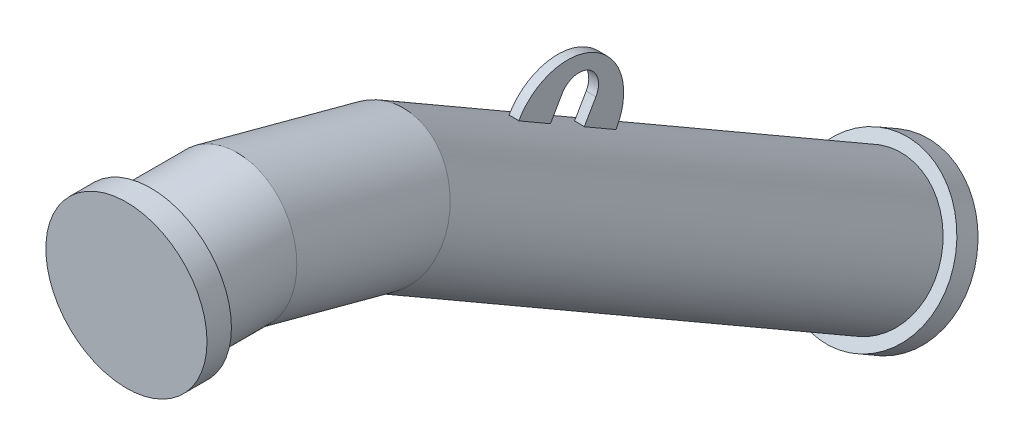
ISO-10303-21;
HEADER;
FILE_DESCRIPTION(('STEP AP214'),'2;1');
FILE_NAME('part.step','',(''),(''),'','','');
FILE_SCHEMA(('AUTOMOTIVE_DESIGN { 1 0 10303 214 1 1 1 1 }'));
ENDSEC;
DATA;
#1=APPLICATION_CONTEXT('core data for automotive mechanical design processes');
#2=APPLICATION_PROTOCOL_DEFINITION('international standard','automotive_design',2000,#1);
#3=PRODUCT_CONTEXT('',#1,'mechanical');
#4=PRODUCT('Part','Part','',(#3));
#5=PRODUCT_RELATED_PRODUCT_CATEGORY('part','',(#4));
#6=PRODUCT_DEFINITION_FORMATION('','',#4);
#7=PRODUCT_DEFINITION_CONTEXT('part definition',#1,'design');
#8=PRODUCT_DEFINITION('design','',#6,#7);
#9=PRODUCT_DEFINITION_SHAPE('','',#8);
#10=(LENGTH_UNIT() NAMED_UNIT(*) SI_UNIT(.MILLI.,.METRE.));
#11=(NAMED_UNIT(*) PLANE_ANGLE_UNIT() SI_UNIT($,.RADIAN.));
#12=(NAMED_UNIT(*) SI_UNIT($,.STERADIAN.) SOLID_ANGLE_UNIT());
#13=UNCERTAINTY_MEASURE_WITH_UNIT(LENGTH_MEASURE(1.E-05),#10,'distance_accuracy_value','');
#14=(GEOMETRIC_REPRESENTATION_CONTEXT(3) GLOBAL_UNCERTAINTY_ASSIGNED_CONTEXT((#13)) GLOBAL_UNIT_ASSIGNED_CONTEXT((#10,
#11,#12)) REPRESENTATION_CONTEXT('',''));
#15=CARTESIAN_POINT('',(0.,0.,0.));
#16=DIRECTION('',(0.,0.,1.));
#17=DIRECTION('',(1.,0.,0.));
#18=AXIS2_PLACEMENT_3D('',#15,#16,#17);
#19=CARTESIAN_POINT('',(4.99999999995946,-49.4113824755163,-458.35254037844));
#20=DIRECTION('',(1.,0.,0.));
#21=DIRECTION('',(0.,0.866025403784438,-0.500000000000001));
#22=AXIS2_PLACEMENT_3D('',#19,#20,#21);
#23=PLANE('',#22);
#24=DIRECTION('',(0.,0.866025403784438,-0.500000000000001));
#25=VECTOR('',#24,1.);
#26=CARTESIAN_POINT('',(4.99999999995948,-49.6732335022949,-391.806079660835));
#27=LINE('',#26,#25);
#28=CARTESIAN_POINT('',(4.99999999995948,-41.2980618055837,-396.64148729444));
#29=VERTEX_POINT('',#28);
#30=CARTESIAN_POINT('',(4.99999999995948,-41.0129794644506,-396.806079660835));
#31=VERTEX_POINT('',#30);
#32=EDGE_CURVE('E246',#29,#31,#27,.T.);
#33=ORIENTED_EDGE('',*,*,#32,.F.);
#34=DIRECTION('',(0.,-0.499999999999988,-0.866025403784404));
#35=VECTOR('',#34,1.);
#36=CARTESIAN_POINT('',(4.99999999995935,-230.552312529383,-724.43946509643));
#37=LINE('',#36,#35);
#38=CARTESIAN_POINT('',(4.9999999999587,-60.0480618055922,-429.117439936366));
#39=VERTEX_POINT('',#38);
#40=EDGE_CURVE('E50',#29,#39,#37,.T.);
#41=ORIENTED_EDGE('',*,*,#40,.T.);
#42=DIRECTION('',(0.,0.866025403784438,-0.500000000000001));
#43=VECTOR('',#42,1.);
#44=CARTESIAN_POINT('',(4.99999999995946,-59.7629794644506,-429.282032302751));
#45=LINE('',#44,#43);
#46=CARTESIAN_POINT('',(4.99999999995946,-39.4113824755163,-441.032032302751));
#47=VERTEX_POINT('',#46);
#48=EDGE_CURVE('E259',#39,#47,#45,.T.);
#49=ORIENTED_EDGE('',*,*,#48,.T.);
#50=CARTESIAN_POINT('',(4.99999999995946,-49.4113824755163,-458.35254037844));
#51=DIRECTION('',(-1.,0.,0.));
#52=DIRECTION('',(0.,0.866025403784438,-0.500000000000001));
#53=AXIS2_PLACEMENT_3D('',#50,#51,#52);
#54=CIRCLE('',#53,20.);
#55=CARTESIAN_POINT('',(4.99999999995945,-59.4113824755163,-475.673048454129));
#56=VERTEX_POINT('',#55);
#57=EDGE_CURVE('E262',#47,#56,#54,.T.);
#58=ORIENTED_EDGE('',*,*,#57,.T.);
#59=DIRECTION('',(0.,-0.866025403784438,0.500000000000001));
#60=VECTOR('',#59,1.);
#61=CARTESIAN_POINT('',(4.99999999995945,-79.7629794644507,-463.923048454129));
#62=LINE('',#61,#60);
#63=CARTESIAN_POINT('',(4.99999999995878,-80.0480618055918,-463.758456087742));
#64=VERTEX_POINT('',#63);
#65=EDGE_CURVE('E266',#56,#64,#62,.T.);
#66=ORIENTED_EDGE('',*,*,#65,.T.);
#67=CARTESIAN_POINT('',(4.99999999995944,-98.7980618055844,-496.234408729651));
#68=VERTEX_POINT('',#67);
#69=EDGE_CURVE('E236',#64,#68,#37,.T.);
#70=ORIENTED_EDGE('',*,*,#69,.T.);
#71=DIRECTION('',(0.,0.866025403784438,-0.500000000000001));
#72=VECTOR('',#71,1.);
#73=CARTESIAN_POINT('',(4.99999999995944,-107.173233502295,-491.399001096045));
#74=LINE('',#73,#72);
#75=CARTESIAN_POINT('',(4.99999999995944,-98.5129794644507,-496.399001096045));
#76=VERTEX_POINT('',#75);
#77=EDGE_CURVE('E252',#68,#76,#74,.T.);
#78=ORIENTED_EDGE('',*,*,#77,.T.);
#79=CARTESIAN_POINT('',(4.99999999995946,-69.7629794644506,-446.60254037844));
#80=DIRECTION('',(1.,0.,0.));
#81=DIRECTION('',(0.,0.866025403784438,-0.500000000000001));
#82=AXIS2_PLACEMENT_3D('',#79,#80,#81);
#83=CIRCLE('',#82,57.5);
#84=EDGE_CURVE('E269',#76,#31,#83,.T.);
#85=ORIENTED_EDGE('',*,*,#84,.T.);
#86=EDGE_LOOP('',(#33,#41,#49,#58,#66,#70,#78,#85));
#87=FACE_BOUND('',#86,.T.);
#88=ADVANCED_FACE('F16',(#87),#23,.T.);
#89=CARTESIAN_POINT('',(-5.00000000004055,-49.4113824755163,-458.35254037844));
#90=DIRECTION('',(1.,0.,0.));
#91=DIRECTION('',(0.,0.866025403784438,-0.500000000000001));
#92=AXIS2_PLACEMENT_3D('',#89,#90,#91);
#93=PLANE('',#92);
#94=DIRECTION('',(0.,-0.499999999999988,-0.866025403784404));
#95=VECTOR('',#94,1.);
#96=CARTESIAN_POINT('',(-5.00000000004065,-230.552312529383,-724.43946509643));
#97=LINE('',#96,#95);
#98=CARTESIAN_POINT('',(-5.00000000004053,-41.2980618055835,-396.641487294441));
#99=VERTEX_POINT('',#98);
#100=CARTESIAN_POINT('',(-5.0000000000413,-60.0480618055922,-429.117439936366));
#101=VERTEX_POINT('',#100);
#102=EDGE_CURVE('E201',#99,#101,#97,.T.);
#103=ORIENTED_EDGE('',*,*,#102,.F.);
#104=DIRECTION('',(0.,0.866025403784438,-0.500000000000001));
#105=VECTOR('',#104,1.);
#106=CARTESIAN_POINT('',(-5.00000000004052,-49.6732335022949,-391.806079660835));
#107=LINE('',#106,#105);
#108=CARTESIAN_POINT('',(-5.00000000004052,-41.0129794644506,-396.806079660835));
#109=VERTEX_POINT('',#108);
#110=EDGE_CURVE('E249',#99,#109,#107,.T.);
#111=ORIENTED_EDGE('',*,*,#110,.T.);
#112=CARTESIAN_POINT('',(-5.00000000004054,-69.7629794644506,-446.60254037844));
#113=DIRECTION('',(1.,0.,0.));
#114=DIRECTION('',(0.,0.866025403784438,-0.500000000000001));
#115=AXIS2_PLACEMENT_3D('',#112,#113,#114);
#116=CIRCLE('',#115,57.5);
#117=CARTESIAN_POINT('',(-5.00000000004056,-98.5129794644507,-496.399001096045));
#118=VERTEX_POINT('',#117);
#119=EDGE_CURVE('E263',#118,#109,#116,.T.);
#120=ORIENTED_EDGE('',*,*,#119,.F.);
#121=DIRECTION('',(0.,0.866025403784438,-0.500000000000001));
#122=VECTOR('',#121,1.);
#123=CARTESIAN_POINT('',(-5.00000000004056,-107.173233502295,-491.399001096045));
#124=LINE('',#123,#122);
#125=CARTESIAN_POINT('',(-5.00000000004056,-98.7980618055842,-496.234408729651));
#126=VERTEX_POINT('',#125);
#127=EDGE_CURVE('E255',#126,#118,#124,.T.);
#128=ORIENTED_EDGE('',*,*,#127,.F.);
#129=CARTESIAN_POINT('',(-5.00000000004122,-80.0480618055918,-463.758456087742));
#130=VERTEX_POINT('',#129);
#131=EDGE_CURVE('E232',#130,#126,#97,.T.);
#132=ORIENTED_EDGE('',*,*,#131,.F.);
#133=DIRECTION('',(0.,-0.866025403784438,0.500000000000001));
#134=VECTOR('',#133,1.);
#135=CARTESIAN_POINT('',(-5.00000000004055,-79.7629794644507,-463.923048454129));
#136=LINE('',#135,#134);
#137=CARTESIAN_POINT('',(-5.00000000004055,-59.4113824755163,-475.673048454129));
#138=VERTEX_POINT('',#137);
#139=EDGE_CURVE('E279',#138,#130,#136,.T.);
#140=ORIENTED_EDGE('',*,*,#139,.F.);
#141=CARTESIAN_POINT('',(-5.00000000004055,-49.4113824755163,-458.35254037844));
#142=DIRECTION('',(-1.,0.,0.));
#143=DIRECTION('',(0.,0.866025403784438,-0.500000000000001));
#144=AXIS2_PLACEMENT_3D('',#141,#142,#143);
#145=CIRCLE('',#144,20.);
#146=CARTESIAN_POINT('',(-5.00000000004054,-39.4113824755163,-441.032032302751));
#147=VERTEX_POINT('',#146);
#148=EDGE_CURVE('E276',#147,#138,#145,.T.);
#149=ORIENTED_EDGE('',*,*,#148,.F.);
#150=DIRECTION('',(0.,0.866025403784438,-0.500000000000001));
#151=VECTOR('',#150,1.);
#152=CARTESIAN_POINT('',(-5.00000000004054,-59.7629794644506,-429.282032302751));
#153=LINE('',#152,#151);
#154=EDGE_CURVE('E258',#101,#147,#153,.T.);
#155=ORIENTED_EDGE('',*,*,#154,.F.);
#156=EDGE_LOOP('',(#103,#111,#120,#128,#132,#140,#149,#155));
#157=FACE_BOUND('',#156,.T.);
#158=ADVANCED_FACE('F310',(#157),#93,.F.);
#159=CARTESIAN_POINT('',(4.99999999995946,-59.7629794644506,-429.282032302751));
#160=DIRECTION('',(0.,0.500000000000001,0.866025403784438));
#161=DIRECTION('',(0.,-0.866025403784438,0.500000000000001));
#162=AXIS2_PLACEMENT_3D('',#159,#160,#161);
#163=PLANE('',#162);
#164=CARTESIAN_POINT('',(-4.19181170721713E-11,-120.384757729375,-394.282032302744));
#165=DIRECTION('',(0.,0.500000000000001,0.866025403784438));
#166=DIRECTION('',(0.,-0.866025403784438,0.500000000000001));
#167=AXIS2_PLACEMENT_3D('',#164,#165,#166);
#168=CIRCLE('',#167,69.85);
#169=EDGE_CURVE('E235',#101,#39,#168,.F.);
#170=ORIENTED_EDGE('',*,*,#169,.F.);
#171=ORIENTED_EDGE('',*,*,#154,.T.);
#172=DIRECTION('',(-1.,0.,0.));
#173=VECTOR('',#172,1.);
#174=CARTESIAN_POINT('',(4.99999999995946,-39.4113824755163,-441.032032302751));
#175=LINE('',#174,#173);
#176=EDGE_CURVE('E26',#47,#147,#175,.T.);
#177=ORIENTED_EDGE('',*,*,#176,.F.);
#178=ORIENTED_EDGE('',*,*,#48,.F.);
#179=EDGE_LOOP('',(#170,#171,#177,#178));
#180=FACE_BOUND('',#179,.T.);
#181=ADVANCED_FACE('F18',(#180),#163,.F.);
#182=CARTESIAN_POINT('',(4.99999999995946,-49.4113824755163,-458.35254037844));
#183=DIRECTION('',(-1.,0.,0.));
#184=DIRECTION('',(0.,-0.866025403784438,0.500000000000001));
#185=AXIS2_PLACEMENT_3D('',#182,#183,#184);
#186=CYLINDRICAL_SURFACE('',#185,20.);
#187=ORIENTED_EDGE('',*,*,#148,.T.);
#188=DIRECTION('',(-1.,0.,0.));
#189=VECTOR('',#188,1.);
#190=CARTESIAN_POINT('',(4.99999999995945,-59.4113824755163,-475.673048454129));
#191=LINE('',#190,#189);
#192=EDGE_CURVE('E292',#56,#138,#191,.T.);
#193=ORIENTED_EDGE('',*,*,#192,.F.);
#194=ORIENTED_EDGE('',*,*,#57,.F.);
#195=ORIENTED_EDGE('',*,*,#176,.T.);
#196=EDGE_LOOP('',(#187,#193,#194,#195));
#197=FACE_BOUND('',#196,.T.);
#198=ADVANCED_FACE('F303',(#197),#186,.F.);
#199=CARTESIAN_POINT('',(4.99999999995945,-79.7629794644507,-463.923048454129));
#200=DIRECTION('',(0.,-0.500000000000001,-0.866025403784438));
#201=DIRECTION('',(0.,0.866025403784438,-0.500000000000001));
#202=AXIS2_PLACEMENT_3D('',#199,#200,#201);
#203=PLANE('',#202);
#204=CARTESIAN_POINT('',(-4.17527740177266E-11,-140.384757729375,-428.923048454121));
#205=DIRECTION('',(0.,-0.500000000000001,-0.866025403784438));
#206=DIRECTION('',(0.,0.866025403784438,-0.500000000000001));
#207=AXIS2_PLACEMENT_3D('',#204,#205,#206);
#208=CIRCLE('',#207,69.85);
#209=EDGE_CURVE('E38',#64,#130,#208,.F.);
#210=ORIENTED_EDGE('',*,*,#209,.F.);
#211=ORIENTED_EDGE('',*,*,#65,.F.);
#212=ORIENTED_EDGE('',*,*,#192,.T.);
#213=ORIENTED_EDGE('',*,*,#139,.T.);
#214=EDGE_LOOP('',(#210,#211,#212,#213));
#215=FACE_BOUND('',#214,.T.);
#216=ADVANCED_FACE('F313',(#215),#203,.F.);
#217=CARTESIAN_POINT('',(4.99999999995946,-69.7629794644506,-446.60254037844));
#218=DIRECTION('',(-1.,0.,0.));
#219=DIRECTION('',(0.,-0.866025403784438,0.500000000000001));
#220=AXIS2_PLACEMENT_3D('',#217,#218,#219);
#221=CYLINDRICAL_SURFACE('',#220,57.5);
#222=ORIENTED_EDGE('',*,*,#119,.T.);
#223=DIRECTION('',(-1.,0.,0.));
#224=VECTOR('',#223,1.);
#225=CARTESIAN_POINT('',(4.99999999995948,-41.0129794644506,-396.806079660835));
#226=LINE('',#225,#224);
#227=EDGE_CURVE('E273',#31,#109,#226,.T.);
#228=ORIENTED_EDGE('',*,*,#227,.F.);
#229=ORIENTED_EDGE('',*,*,#84,.F.);
#230=DIRECTION('',(-1.,0.,0.));
#231=VECTOR('',#230,1.);
#232=CARTESIAN_POINT('',(4.99999999995944,-98.5129794644507,-496.399001096045));
#233=LINE('',#232,#231);
#234=EDGE_CURVE('E288',#76,#118,#233,.T.);
#235=ORIENTED_EDGE('',*,*,#234,.T.);
#236=EDGE_LOOP('',(#222,#228,#229,#235));
#237=FACE_BOUND('',#236,.T.);
#238=ADVANCED_FACE('F760',(#237),#221,.T.);
#239=CARTESIAN_POINT('',(-5.00000000004056,-107.173233502295,-491.399001096045));
#240=DIRECTION('',(0.,0.500000000000001,0.866025403784438));
#241=DIRECTION('',(0.,-0.866025403784438,0.500000000000001));
#242=AXIS2_PLACEMENT_3D('',#239,#240,#241);
#243=PLANE('',#242);
#244=CARTESIAN_POINT('',(-4.15977649041847E-11,-159.134757729375,-461.399001096037));
#245=DIRECTION('',(0.,0.500000000000001,0.866025403784438));
#246=DIRECTION('',(0.,-0.866025403784438,0.500000000000001));
#247=AXIS2_PLACEMENT_3D('',#244,#245,#246);
#248=CIRCLE('',#247,69.85);
#249=EDGE_CURVE('E240',#126,#68,#248,.F.);
#250=ORIENTED_EDGE('',*,*,#249,.F.);
#251=ORIENTED_EDGE('',*,*,#127,.T.);
#252=ORIENTED_EDGE('',*,*,#234,.F.);
#253=ORIENTED_EDGE('',*,*,#77,.F.);
#254=EDGE_LOOP('',(#250,#251,#252,#253));
#255=FACE_BOUND('',#254,.T.);
#256=ADVANCED_FACE('F752',(#255),#243,.F.);
#257=CARTESIAN_POINT('',(4.99999999995948,-49.6732335022949,-391.806079660835));
#258=DIRECTION('',(0.,-0.500000000000001,-0.866025403784438));
#259=DIRECTION('',(0.,0.866025403784438,-0.500000000000001));
#260=AXIS2_PLACEMENT_3D('',#257,#258,#259);
#261=PLANE('',#260);
#262=CARTESIAN_POINT('',(-4.20731261857132E-11,-101.634757729374,-361.806079660827));
#263=DIRECTION('',(0.,-0.500000000000001,-0.866025403784438));
#264=DIRECTION('',(0.,0.866025403784438,-0.500000000000001));
#265=AXIS2_PLACEMENT_3D('',#262,#263,#264);
#266=CIRCLE('',#265,69.85);
#267=EDGE_CURVE('E10',#29,#99,#266,.F.);
#268=ORIENTED_EDGE('',*,*,#267,.F.);
#269=ORIENTED_EDGE('',*,*,#32,.T.);
#270=ORIENTED_EDGE('',*,*,#227,.T.);
#271=ORIENTED_EDGE('',*,*,#110,.F.);
#272=EDGE_LOOP('',(#268,#269,#270,#271));
#273=FACE_BOUND('',#272,.T.);
#274=ADVANCED_FACE('F744',(#273),#261,.F.);
#275=CARTESIAN_POINT('',(-4.05085323916473E-11,-290.889008453172,-689.604057462818));
#276=DIRECTION('',(0.,-0.499999999999988,-0.866025403784404));
#277=DIRECTION('',(-0.999999999999976,0.,0.));
#278=AXIS2_PLACEMENT_3D('',#275,#276,#277);
#279=CYLINDRICAL_SURFACE('',#278,69.85);
#280=CARTESIAN_POINT('',(-4.05288457578064E-11,-330.384757729362,-758.012701892215));
#281=DIRECTION('',(0.,0.499999999999988,0.866025403784404));
#282=DIRECTION('',(0.999999999999976,0.,0.));
#283=AXIS2_PLACEMENT_3D('',#280,#281,#282);
#284=CIRCLE('',#283,69.85);
#285=CARTESIAN_POINT('',(69.8499999999578,-330.384757729362,-758.012701892215));
#286=VERTEX_POINT('',#285);
#287=EDGE_CURVE('E197',#286,#286,#284,.T.);
#288=ORIENTED_EDGE('',*,*,#287,.T.);
#289=EDGE_LOOP('',(#288));
#290=FACE_BOUND('',#289,.T.);
#291=CARTESIAN_POINT('',(0.,-40.8890084530968,-256.591355570629));
#292=DIRECTION('',(0.,-0.382683432365093,-0.92387953251128));
#293=DIRECTION('',(0.,-0.923879532511316,0.382683432365102));
#294=AXIS2_PLACEMENT_3D('',#291,#292,#293);
#295=ELLIPSE('',#294,70.4527328965237,69.85);
#296=CARTESIAN_POINT('',(-3.78745811221685E-13,-105.978846385682,-229.630261926286));
#297=VERTEX_POINT('',#296);
#298=EDGE_CURVE('E189',#297,#297,#295,.T.);
#299=ORIENTED_EDGE('',*,*,#298,.T.);
#300=EDGE_LOOP('',(#299));
#301=FACE_BOUND('',#300,.T.);
#302=ORIENTED_EDGE('',*,*,#102,.T.);
#303=ORIENTED_EDGE('',*,*,#169,.T.);
#304=ORIENTED_EDGE('',*,*,#40,.F.);
#305=ORIENTED_EDGE('',*,*,#267,.T.);
#306=EDGE_LOOP('',(#302,#303,#304,#305));
#307=FACE_BOUND('',#306,.T.);
#308=ORIENTED_EDGE('',*,*,#69,.F.);
#309=ORIENTED_EDGE('',*,*,#209,.T.);
#310=ORIENTED_EDGE('',*,*,#131,.T.);
#311=ORIENTED_EDGE('',*,*,#249,.T.);
#312=EDGE_LOOP('',(#308,#309,#310,#311));
#313=FACE_BOUND('',#312,.T.);
#314=ADVANCED_FACE('F316',(#290,#301,#307,#313),#279,.T.);
#315=CARTESIAN_POINT('',(-4.12182953475823E-11,-342.884757729361,-779.663336986825));
#316=DIRECTION('',(0.,-0.499999999999968,-0.866025403784361));
#317=DIRECTION('',(-1.00000000000005,0.,0.));
#318=AXIS2_PLACEMENT_3D('',#315,#316,#317);
#319=PLANE('',#318);
#320=CARTESIAN_POINT('',(-4.12182953475823E-11,-342.884757729361,-779.663336986825));
#321=DIRECTION('',(0.,-0.499999999999968,-0.866025403784361));
#322=DIRECTION('',(-1.00000000000005,0.,0.));
#323=AXIS2_PLACEMENT_3D('',#320,#321,#322);
#324=CIRCLE('',#323,82.5);
#325=CARTESIAN_POINT('',(-82.5000000000457,-342.884757729361,-779.663336986824));
#326=VERTEX_POINT('',#325);
#327=EDGE_CURVE('E211',#326,#326,#324,.T.);
#328=ORIENTED_EDGE('',*,*,#327,.T.);
#329=EDGE_LOOP('',(#328));
#330=FACE_BOUND('',#329,.T.);
#331=ADVANCED_FACE('F519',(#330),#319,.T.);
#332=CARTESIAN_POINT('',(1.42042706636348E-12,-330.384757729348,-758.012701892223));
#333=DIRECTION('',(0.,-0.499999999999968,-0.866025403784361));
#334=DIRECTION('',(-1.00000000000005,0.,0.));
#335=AXIS2_PLACEMENT_3D('',#332,#333,#334);
#336=CYLINDRICAL_SURFACE('',#335,82.5);
#337=CARTESIAN_POINT('',(1.42042706636348E-12,-330.384757729348,-758.012701892223));
#338=DIRECTION('',(0.,-0.499999999999968,-0.866025403784361));
#339=DIRECTION('',(-1.00000000000005,0.,0.));
#340=AXIS2_PLACEMENT_3D('',#337,#338,#339);
#341=CIRCLE('',#340,82.5);
#342=CARTESIAN_POINT('',(-82.5000000000031,-330.384757729348,-758.012701892222));
#343=VERTEX_POINT('',#342);
#344=EDGE_CURVE('E202',#343,#343,#341,.T.);
#345=ORIENTED_EDGE('',*,*,#344,.T.);
#346=EDGE_LOOP('',(#345));
#347=FACE_BOUND('',#346,.T.);
#348=ORIENTED_EDGE('',*,*,#327,.F.);
#349=EDGE_LOOP('',(#348));
#350=FACE_BOUND('',#349,.T.);
#351=ADVANCED_FACE('F426',(#347,#350),#336,.T.);
#352=CARTESIAN_POINT('',(1.42042706636348E-12,-330.384757729348,-758.012701892223));
#353=DIRECTION('',(0.,-0.499999999999968,-0.866025403784361));
#354=DIRECTION('',(-1.00000000000005,0.,0.));
#355=AXIS2_PLACEMENT_3D('',#352,#353,#354);
#356=PLANE('',#355);
#357=ORIENTED_EDGE('',*,*,#287,.F.);
#358=EDGE_LOOP('',(#357));
#359=FACE_BOUND('',#358,.T.);
#360=ORIENTED_EDGE('',*,*,#344,.F.);
#361=EDGE_LOOP('',(#360));
#362=FACE_BOUND('',#361,.T.);
#363=ADVANCED_FACE('F471',(#359,#362),#356,.F.);
#364=CARTESIAN_POINT('',(0.,0.,0.));
#365=DIRECTION('',(0.,0.,0.999999999999917));
#366=DIRECTION('',(1.00000000000005,0.,0.));
#367=AXIS2_PLACEMENT_3D('',#364,#365,#366);
#368=PLANE('',#367);
#369=CARTESIAN_POINT('',(0.,0.,0.));
#370=DIRECTION('',(0.,0.,0.999999999999917));
#371=DIRECTION('',(1.00000000000005,0.,0.));
#372=AXIS2_PLACEMENT_3D('',#369,#370,#371);
#373=CIRCLE('',#372,82.5);
#374=CARTESIAN_POINT('',(82.5000000000045,-8.39568894189887E-13,-2.91044771522028E-13));
#375=VERTEX_POINT('',#374);
#376=EDGE_CURVE('E216',#375,#375,#373,.T.);
#377=ORIENTED_EDGE('',*,*,#376,.T.);
#378=EDGE_LOOP('',(#377));
#379=FACE_BOUND('',#378,.T.);
#380=ADVANCED_FACE('F475',(#379),#368,.T.);
#381=CARTESIAN_POINT('',(-4.2632564145606E-11,1.59872115546022E-11,-24.9999999999986));
#382=DIRECTION('',(0.,0.,0.999999999999917));
#383=DIRECTION('',(1.00000000000005,0.,0.));
#384=AXIS2_PLACEMENT_3D('',#381,#382,#383);
#385=CYLINDRICAL_SURFACE('',#384,82.5);
#386=CARTESIAN_POINT('',(-4.2632564145606E-11,1.59872115546022E-11,-24.9999999999986));
#387=DIRECTION('',(0.,0.,0.999999999999917));
#388=DIRECTION('',(1.00000000000005,0.,0.));
#389=AXIS2_PLACEMENT_3D('',#386,#387,#388);
#390=CIRCLE('',#389,82.5);
#391=CARTESIAN_POINT('',(82.4999999999618,1.51476426604124E-11,-24.9999999999989));
#392=VERTEX_POINT('',#391);
#393=EDGE_CURVE('E212',#392,#392,#390,.T.);
#394=ORIENTED_EDGE('',*,*,#393,.T.);
#395=EDGE_LOOP('',(#394));
#396=FACE_BOUND('',#395,.T.);
#397=ORIENTED_EDGE('',*,*,#376,.F.);
#398=EDGE_LOOP('',(#397));
#399=FACE_BOUND('',#398,.T.);
#400=ADVANCED_FACE('F509',(#396,#399),#385,.T.);
#401=CARTESIAN_POINT('',(-4.2632564145606E-11,1.59872115546022E-11,-24.9999999999986));
#402=DIRECTION('',(0.,0.,0.999999999999917));
#403=DIRECTION('',(1.00000000000005,0.,0.));
#404=AXIS2_PLACEMENT_3D('',#401,#402,#403);
#405=PLANE('',#404);
#406=CARTESIAN_POINT('',(0.,0.,-24.9999999999986));
#407=DIRECTION('',(0.,0.,-0.999999999999964));
#408=DIRECTION('',(-0.999999999999976,0.,0.));
#409=AXIS2_PLACEMENT_3D('',#406,#407,#408);
#410=CIRCLE('',#409,69.85);
#411=CARTESIAN_POINT('',(-69.8499999999983,-2.55500211454485E-13,-24.9999999999983));
#412=VERTEX_POINT('',#411);
#413=EDGE_CURVE('E207',#412,#412,#410,.T.);
#414=ORIENTED_EDGE('',*,*,#413,.F.);
#415=EDGE_LOOP('',(#414));
#416=FACE_BOUND('',#415,.T.);
#417=ORIENTED_EDGE('',*,*,#393,.F.);
#418=EDGE_LOOP('',(#417));
#419=FACE_BOUND('',#418,.T.);
#420=ADVANCED_FACE('F706',(#416,#419),#405,.F.);
#421=CARTESIAN_POINT('',(0.,-1.73056013963446E-11,-103.991498552409));
#422=DIRECTION('',(0.,0.,0.999999999999964));
#423=DIRECTION('',(0.999999999999976,0.,0.));
#424=AXIS2_PLACEMENT_3D('',#421,#422,#423);
#425=CYLINDRICAL_SURFACE('',#424,69.85);
#426=ORIENTED_EDGE('',*,*,#413,.T.);
#427=EDGE_LOOP('',(#426));
#428=FACE_BOUND('',#427,.T.);
#429=CARTESIAN_POINT('',(0.,-1.73056013963446E-11,-103.991498552409));
#430=DIRECTION('',(0.,-0.130526192220051,-0.991444861373775));
#431=DIRECTION('',(0.,-0.991444861373834,0.130526192220052));
#432=AXIS2_PLACEMENT_3D('',#429,#430,#431);
#433=ELLIPSE('',#432,70.4527328965237,69.85);
#434=CARTESIAN_POINT('',(-2.96148545480706E-13,-69.850000000019,-94.7955715959292));
#435=VERTEX_POINT('',#434);
#436=EDGE_CURVE('E206',#435,#435,#433,.T.);
#437=ORIENTED_EDGE('',*,*,#436,.F.);
#438=EDGE_LOOP('',(#437));
#439=FACE_BOUND('',#438,.T.);
#440=ADVANCED_FACE('F697',(#428,#439),#425,.T.);
#441=CARTESIAN_POINT('',(0.,-40.8890084530968,-256.591355570629));
#442=DIRECTION('',(0.,0.258819045102518,0.965925826289065));
#443=DIRECTION('',(0.,-0.965925826289096,0.25881904510253));
#444=AXIS2_PLACEMENT_3D('',#441,#442,#443);
#445=CYLINDRICAL_SURFACE('',#444,69.85);
#446=ORIENTED_EDGE('',*,*,#298,.F.);
#447=EDGE_LOOP('',(#446));
#448=FACE_BOUND('',#447,.T.);
#449=ORIENTED_EDGE('',*,*,#436,.T.);
#450=EDGE_LOOP('',(#449));
#451=FACE_BOUND('',#450,.T.);
#452=ADVANCED_FACE('F693',(#448,#451),#445,.T.);
#453=CLOSED_SHELL('',(#88,#158,#181,#198,#216,#238,#256,#274,#314,#331,#351,#363,#380,#400,#420,
#440,#452));
#454=CARTESIAN_POINT('',(0.,0.,-25.));
#455=DIRECTION('',(0.,0.,1.));
#456=DIRECTION('',(1.,0.,0.));
#457=AXIS2_PLACEMENT_3D('',#454,#455,#456);
#458=PLANE('',#457);
#459=CARTESIAN_POINT('',(-2.50451802009264E-12,-7.7715611723761E-13,-24.9999999999986));
#460=DIRECTION('',(0.,0.,1.));
#461=DIRECTION('',(1.,0.,0.));
#462=AXIS2_PLACEMENT_3D('',#459,#460,#461);
#463=CIRCLE('',#462,27.);
#464=CARTESIAN_POINT('',(-2.612225327386E-12,26.9999999999992,-24.9999999999986));
#465=VERTEX_POINT('',#464);
#466=EDGE_CURVE('E190',#465,#465,#463,.F.);
#467=ORIENTED_EDGE('',*,*,#466,.T.);
#468=EDGE_LOOP('',(#467));
#469=FACE_BOUND('',#468,.T.);
#470=ADVANCED_FACE('F522',(#469),#458,.F.);
#471=CARTESIAN_POINT('',(-1.11022302462516E-13,-600.000000000001,-24.9999999999986));
#472=DIRECTION('',(-0.999999999999988,0.,0.));
#473=DIRECTION('',(0.,0.,1.));
#474=AXIS2_PLACEMENT_3D('',#471,#472,#473);
#475=TOROIDAL_SURFACE('',#474,600.,27.);
#476=CARTESIAN_POINT('',(-1.27692576555864E-12,-80.3847577293402,-325.000000000007));
#477=DIRECTION('',(0.,0.500000000000002,0.866025403784438));
#478=DIRECTION('',(1.,0.,0.));
#479=AXIS2_PLACEMENT_3D('',#476,#477,#478);
#480=CIRCLE('',#479,27.);
#481=CARTESIAN_POINT('',(-1.32939142139796E-12,-57.0020718271623,-338.500000000007));
#482=VERTEX_POINT('',#481);
#483=EDGE_CURVE('E184',#482,#482,#480,.T.);
#484=CARTESIAN_POINT('',(-1.11022302462516E-13,-600.000000000001,-24.9999999999986));
#485=DIRECTION('',(-0.999999999999988,0.,0.));
#486=DIRECTION('',(0.,0.,1.));
#487=AXIS2_PLACEMENT_3D('',#484,#485,#486);
#488=CIRCLE('',#487,627.);
#489=EDGE_CURVE('',#465,#482,#488,.T.);
#490=ORIENTED_EDGE('',*,*,#466,.F.);
#491=ORIENTED_EDGE('',*,*,#483,.F.);
#492=ORIENTED_EDGE('',*,*,#489,.T.);
#493=ORIENTED_EDGE('',*,*,#489,.F.);
#494=EDGE_LOOP('',(#490,#492,#491,#493));
#495=FACE_BOUND('',#494,.T.);
#496=ADVANCED_FACE('F526',(#495),#475,.F.);
#497=CARTESIAN_POINT('',(-1.27692576555864E-12,-80.3847577293402,-325.000000000007));
#498=DIRECTION('',(0.,-0.500000000000002,-0.866025403784438));
#499=DIRECTION('',(-1.,0.,0.));
#500=AXIS2_PLACEMENT_3D('',#497,#498,#499);
#501=CYLINDRICAL_SURFACE('',#500,27.);
#502=ORIENTED_EDGE('',*,*,#483,.T.);
#503=EDGE_LOOP('',(#502));
#504=FACE_BOUND('',#503,.T.);
#505=CARTESIAN_POINT('',(-1.40201191962115E-12,-340.384757729339,-775.333209967912));
#506=DIRECTION('',(0.,0.499999999999968,0.866025403784361));
#507=DIRECTION('',(0.,-0.866025403784433,0.50000000000001));
#508=AXIS2_PLACEMENT_3D('',#505,#506,#507);
#509=CIRCLE('',#508,27.);
#510=CARTESIAN_POINT('',(-1.40201191962115E-12,-363.767443631519,-761.833209967912));
#511=VERTEX_POINT('',#510);
#512=EDGE_CURVE('E185',#511,#511,#509,.T.);
#513=ORIENTED_EDGE('',*,*,#512,.F.);
#514=EDGE_LOOP('',(#513));
#515=FACE_BOUND('',#514,.T.);
#516=ADVANCED_FACE('F536',(#504,#515),#501,.F.);
#517=CARTESIAN_POINT('',(4.93771351154984E-11,-340.384757729386,-775.333209967885));
#518=DIRECTION('',(0.,0.499999999999968,0.866025403784361));
#519=DIRECTION('',(1.00000000000005,0.,0.));
#520=AXIS2_PLACEMENT_3D('',#517,#518,#519);
#521=PLANE('',#520);
#522=ORIENTED_EDGE('',*,*,#512,.T.);
#523=EDGE_LOOP('',(#522));
#524=FACE_BOUND('',#523,.T.);
#525=ADVANCED_FACE('F533',(#524),#521,.T.);
#526=CLOSED_SHELL('',(#470,#496,#516,#525));
#527=CARTESIAN_POINT('',(-44.1941738242023,44.1941738242919,-20.000000000036));
#528=DIRECTION('',(0.,0.,0.999999999999917));
#529=DIRECTION('',(0.,-1.,0.));
#530=AXIS2_PLACEMENT_3D('',#527,#528,#529);
#531=PLANE('',#530);
#532=CARTESIAN_POINT('',(-44.1941738242023,44.1941738242919,-20.000000000036));
#533=DIRECTION('',(0.,0.,0.999999999999917));
#534=DIRECTION('',(1.00000000000005,0.,0.));
#535=AXIS2_PLACEMENT_3D('',#532,#533,#534);
#536=CIRCLE('',#535,7.);
#537=CARTESIAN_POINT('',(-37.1941738242019,44.1941738242918,-20.000000000036));
#538=VERTEX_POINT('',#537);
#539=EDGE_CURVE('E151',#538,#538,#536,.T.);
#540=ORIENTED_EDGE('',*,*,#539,.F.);
#541=EDGE_LOOP('',(#540));
#542=FACE_BOUND('',#541,.T.);
#543=ADVANCED_FACE('F458',(#542),#531,.F.);
#544=CARTESIAN_POINT('',(-44.1941738242023,44.1941738242919,-20.000000000036));
#545=DIRECTION('',(0.,0.,0.999999999999917));
#546=DIRECTION('',(1.00000000000005,0.,0.));
#547=AXIS2_PLACEMENT_3D('',#544,#545,#546);
#548=CONICAL_SURFACE('',#547,7.,1.02974425867665);
#549=CARTESIAN_POINT('',(-44.1941738242022,44.1941738243044,-24.2060243332212));
#550=VERTEX_POINT('',#549);
#551=VERTEX_LOOP('',#550);
#552=FACE_BOUND('',#551,.T.);
#553=ORIENTED_EDGE('',*,*,#539,.T.);
#554=EDGE_LOOP('',(#553));
#555=FACE_BOUND('',#554,.T.);
#556=ADVANCED_FACE('F455',(#552,#555),#548,.F.);
#557=CLOSED_SHELL('',(#543,#556));
#558=CARTESIAN_POINT('',(44.1941738241982,-371.158034960236,-740.245741999129));
#559=DIRECTION('',(0.,-0.499999999999968,-0.866025403784361));
#560=DIRECTION('',(0.,0.866025403784433,-0.50000000000001));
#561=AXIS2_PLACEMENT_3D('',#558,#559,#560);
#562=PLANE('',#561);
#563=CARTESIAN_POINT('',(44.1941738241982,-371.158034960236,-740.245741999129));
#564=DIRECTION('',(0.,-0.499999999999968,-0.866025403784361));
#565=DIRECTION('',(-1.00000000000005,0.,0.));
#566=AXIS2_PLACEMENT_3D('',#563,#564,#565);
#567=CIRCLE('',#566,6.99999999999999);
#568=CARTESIAN_POINT('',(37.1941738241979,-371.158034960236,-740.245741999129));
#569=VERTEX_POINT('',#568);
#570=EDGE_CURVE('E159',#569,#569,#567,.T.);
#571=ORIENTED_EDGE('',*,*,#570,.F.);
#572=EDGE_LOOP('',(#571));
#573=FACE_BOUND('',#572,.T.);
#574=ADVANCED_FACE('F493',(#573),#562,.F.);
#575=CARTESIAN_POINT('',(44.1941738241982,-371.158034960236,-740.245741999129));
#576=DIRECTION('',(0.,-0.499999999999968,-0.866025403784361));
#577=DIRECTION('',(-1.00000000000005,0.,0.));
#578=AXIS2_PLACEMENT_3D('',#575,#576,#577);
#579=CONICAL_SURFACE('',#578,6.99999999999999,1.02974425867665);
#580=CARTESIAN_POINT('',(44.1941738242391,-369.055022793636,-736.603218077646));
#581=VERTEX_POINT('',#580);
#582=VERTEX_LOOP('',#581);
#583=FACE_BOUND('',#582,.T.);
#584=ORIENTED_EDGE('',*,*,#570,.T.);
#585=EDGE_LOOP('',(#584));
#586=FACE_BOUND('',#585,.T.);
#587=ADVANCED_FACE('F496',(#583,#586),#579,.F.);
#588=CLOSED_SHELL('',(#574,#587));
#589=CARTESIAN_POINT('',(-44.1941738241209,-371.158034960338,-740.245741999102));
#590=DIRECTION('',(0.,-0.499999999999968,-0.866025403784361));
#591=DIRECTION('',(0.,0.866025403784433,-0.50000000000001));
#592=AXIS2_PLACEMENT_3D('',#589,#590,#591);
#593=PLANE('',#592);
#594=CARTESIAN_POINT('',(-44.1941738241209,-371.158034960338,-740.245741999102));
#595=DIRECTION('',(0.,-0.499999999999968,-0.866025403784361));
#596=DIRECTION('',(-1.00000000000005,0.,0.));
#597=AXIS2_PLACEMENT_3D('',#594,#595,#596);
#598=CIRCLE('',#597,7.);
#599=CARTESIAN_POINT('',(-51.1941738241213,-371.158034960338,-740.245741999102));
#600=VERTEX_POINT('',#599);
#601=EDGE_CURVE('E171',#600,#600,#598,.T.);
#602=ORIENTED_EDGE('',*,*,#601,.F.);
#603=EDGE_LOOP('',(#602));
#604=FACE_BOUND('',#603,.T.);
#605=ADVANCED_FACE('F666',(#604),#593,.F.);
#606=CARTESIAN_POINT('',(-44.1941738241209,-371.158034960338,-740.245741999102));
#607=DIRECTION('',(0.,-0.499999999999968,-0.866025403784361));
#608=DIRECTION('',(-1.00000000000005,0.,0.));
#609=AXIS2_PLACEMENT_3D('',#606,#607,#608);
#610=CONICAL_SURFACE('',#609,7.,1.02974425867665);
#611=CARTESIAN_POINT('',(-44.1941738240801,-369.05502279377,-736.603218077619));
#612=VERTEX_POINT('',#611);
#613=VERTEX_LOOP('',#612);
#614=FACE_BOUND('',#613,.T.);
#615=ORIENTED_EDGE('',*,*,#601,.T.);
#616=EDGE_LOOP('',(#615));
#617=FACE_BOUND('',#616,.T.);
#618=ADVANCED_FACE('F662',(#614,#617),#610,.F.);
#619=CLOSED_SHELL('',(#605,#618));
#620=CARTESIAN_POINT('',(-44.194173824158,-294.611480498358,-784.439915823219));
#621=DIRECTION('',(0.,-0.499999999999968,-0.866025403784361));
#622=DIRECTION('',(0.,0.866025403784433,-0.50000000000001));
#623=AXIS2_PLACEMENT_3D('',#620,#621,#622);
#624=PLANE('',#623);
#625=CARTESIAN_POINT('',(-44.194173824158,-294.611480498358,-784.439915823219));
#626=DIRECTION('',(0.,-0.499999999999968,-0.866025403784361));
#627=DIRECTION('',(-1.00000000000005,0.,0.));
#628=AXIS2_PLACEMENT_3D('',#625,#626,#627);
#629=CIRCLE('',#628,7.);
#630=CARTESIAN_POINT('',(-51.1941738241584,-294.611480498358,-784.439915823219));
#631=VERTEX_POINT('',#630);
#632=EDGE_CURVE('E173',#631,#631,#629,.T.);
#633=ORIENTED_EDGE('',*,*,#632,.F.);
#634=EDGE_LOOP('',(#633));
#635=FACE_BOUND('',#634,.T.);
#636=ADVANCED_FACE('F651',(#635),#624,.F.);
#637=CARTESIAN_POINT('',(-44.194173824158,-294.611480498358,-784.439915823219));
#638=DIRECTION('',(0.,-0.499999999999968,-0.866025403784361));
#639=DIRECTION('',(-1.00000000000005,0.,0.));
#640=AXIS2_PLACEMENT_3D('',#637,#638,#639);
#641=CONICAL_SURFACE('',#640,7.,1.02974425867665);
#642=CARTESIAN_POINT('',(-44.1941738241581,-292.508468331777,-780.797391901742));
#643=VERTEX_POINT('',#642);
#644=VERTEX_LOOP('',#643);
#645=FACE_BOUND('',#644,.T.);
#646=ORIENTED_EDGE('',*,*,#632,.T.);
#647=EDGE_LOOP('',(#646));
#648=FACE_BOUND('',#647,.T.);
#649=ADVANCED_FACE('F647',(#645,#648),#641,.F.);
#650=CLOSED_SHELL('',(#636,#649));
#651=CARTESIAN_POINT('',(44.1941738241168,44.1941738241747,-20.0000000000049));
#652=DIRECTION('',(0.,0.,0.999999999999917));
#653=DIRECTION('',(0.,-1.,0.));
#654=AXIS2_PLACEMENT_3D('',#651,#652,#653);
#655=PLANE('',#654);
#656=CARTESIAN_POINT('',(44.1941738241168,44.1941738241747,-20.0000000000049));
#657=DIRECTION('',(0.,0.,0.999999999999917));
#658=DIRECTION('',(1.00000000000005,0.,0.));
#659=AXIS2_PLACEMENT_3D('',#656,#657,#658);
#660=CIRCLE('',#659,7.);
#661=CARTESIAN_POINT('',(51.1941738241172,44.1941738241746,-20.0000000000049));
#662=VERTEX_POINT('',#661);
#663=EDGE_CURVE('E148',#662,#662,#660,.T.);
#664=ORIENTED_EDGE('',*,*,#663,.F.);
#665=EDGE_LOOP('',(#664));
#666=FACE_BOUND('',#665,.T.);
#667=ADVANCED_FACE('F142',(#666),#655,.F.);
#668=CARTESIAN_POINT('',(44.1941738241168,44.1941738241747,-20.0000000000049));
#669=DIRECTION('',(0.,0.,0.999999999999917));
#670=DIRECTION('',(1.00000000000005,0.,0.));
#671=AXIS2_PLACEMENT_3D('',#668,#669,#670);
#672=CONICAL_SURFACE('',#671,7.,1.02974425867665);
#673=CARTESIAN_POINT('',(44.1941738241169,44.1941738241631,-24.2060243331874));
#674=VERTEX_POINT('',#673);
#675=VERTEX_LOOP('',#674);
#676=FACE_BOUND('',#675,.T.);
#677=ORIENTED_EDGE('',*,*,#663,.T.);
#678=EDGE_LOOP('',(#677));
#679=FACE_BOUND('',#678,.T.);
#680=ADVANCED_FACE('F139',(#676,#679),#672,.F.);
#681=CLOSED_SHELL('',(#667,#680));
#682=CARTESIAN_POINT('',(44.1941738240796,-44.1941738241276,-19.9999999999658));
#683=DIRECTION('',(0.,0.,0.999999999999917));
#684=DIRECTION('',(0.,-1.,0.));
#685=AXIS2_PLACEMENT_3D('',#682,#683,#684);
#686=PLANE('',#685);
#687=CARTESIAN_POINT('',(44.1941738240796,-44.1941738241276,-19.9999999999658));
#688=DIRECTION('',(0.,0.,0.999999999999917));
#689=DIRECTION('',(1.00000000000005,0.,0.));
#690=AXIS2_PLACEMENT_3D('',#687,#688,#689);
#691=CIRCLE('',#690,7.);
#692=CARTESIAN_POINT('',(51.19417382408,-44.1941738241277,-19.9999999999658));
#693=VERTEX_POINT('',#692);
#694=EDGE_CURVE('E152',#693,#693,#691,.T.);
#695=ORIENTED_EDGE('',*,*,#694,.F.);
#696=EDGE_LOOP('',(#695));
#697=FACE_BOUND('',#696,.T.);
#698=ADVANCED_FACE('F630',(#697),#686,.F.);
#699=CARTESIAN_POINT('',(44.1941738240796,-44.1941738241276,-19.9999999999658));
#700=DIRECTION('',(0.,0.,0.999999999999917));
#701=DIRECTION('',(1.00000000000005,0.,0.));
#702=AXIS2_PLACEMENT_3D('',#699,#700,#701);
#703=CONICAL_SURFACE('',#702,7.,1.02974425867665);
#704=CARTESIAN_POINT('',(44.1941738240388,-44.1941738241542,-24.2060243331466));
#705=VERTEX_POINT('',#704);
#706=VERTEX_LOOP('',#705);
#707=FACE_BOUND('',#706,.T.);
#708=ORIENTED_EDGE('',*,*,#694,.T.);
#709=EDGE_LOOP('',(#708));
#710=FACE_BOUND('',#709,.T.);
#711=ADVANCED_FACE('F549',(#707,#710),#703,.F.);
#712=CLOSED_SHELL('',(#698,#711));
#713=CARTESIAN_POINT('',(-44.1941738242395,-44.1941738240255,-19.9999999999934));
#714=DIRECTION('',(0.,0.,0.999999999999917));
#715=DIRECTION('',(0.,-1.,0.));
#716=AXIS2_PLACEMENT_3D('',#713,#714,#715);
#717=PLANE('',#716);
#718=CARTESIAN_POINT('',(-44.1941738242395,-44.1941738240255,-19.9999999999934));
#719=DIRECTION('',(0.,0.,0.999999999999917));
#720=DIRECTION('',(1.00000000000005,0.,0.));
#721=AXIS2_PLACEMENT_3D('',#718,#719,#720);
#722=CIRCLE('',#721,6.99999999999999);
#723=CARTESIAN_POINT('',(-37.1941738242391,-44.1941738240255,-19.9999999999934));
#724=VERTEX_POINT('',#723);
#725=EDGE_CURVE('E163',#724,#724,#722,.T.);
#726=ORIENTED_EDGE('',*,*,#725,.F.);
#727=EDGE_LOOP('',(#726));
#728=FACE_BOUND('',#727,.T.);
#729=ADVANCED_FACE('F437',(#728),#717,.F.);
#730=CARTESIAN_POINT('',(-44.1941738242395,-44.1941738240255,-19.9999999999934));
#731=DIRECTION('',(0.,0.,0.999999999999917));
#732=DIRECTION('',(1.00000000000005,0.,0.));
#733=AXIS2_PLACEMENT_3D('',#730,#731,#732);
#734=CONICAL_SURFACE('',#733,6.99999999999999,1.02974425867665);
#735=CARTESIAN_POINT('',(-44.1941738242804,-44.1941738240237,-24.2060243331901));
#736=VERTEX_POINT('',#735);
#737=VERTEX_LOOP('',#736);
#738=FACE_BOUND('',#737,.T.);
#739=ORIENTED_EDGE('',*,*,#725,.T.);
#740=EDGE_LOOP('',(#739));
#741=FACE_BOUND('',#740,.T.);
#742=ADVANCED_FACE('F442',(#738,#741),#734,.F.);
#743=CLOSED_SHELL('',(#729,#742));
#744=CARTESIAN_POINT('',(44.1941738241612,-294.611480498241,-784.439915823251));
#745=DIRECTION('',(0.,-0.499999999999968,-0.866025403784361));
#746=DIRECTION('',(0.,0.866025403784433,-0.50000000000001));
#747=AXIS2_PLACEMENT_3D('',#744,#745,#746);
#748=PLANE('',#747);
#749=CARTESIAN_POINT('',(44.1941738241612,-294.611480498241,-784.439915823251));
#750=DIRECTION('',(0.,-0.499999999999968,-0.866025403784361));
#751=DIRECTION('',(-1.00000000000005,0.,0.));
#752=AXIS2_PLACEMENT_3D('',#749,#750,#751);
#753=CIRCLE('',#752,7.);
#754=CARTESIAN_POINT('',(37.1941738241608,-294.611480498241,-784.439915823251));
#755=VERTEX_POINT('',#754);
#756=EDGE_CURVE('E177',#755,#755,#753,.T.);
#757=ORIENTED_EDGE('',*,*,#756,.F.);
#758=EDGE_LOOP('',(#757));
#759=FACE_BOUND('',#758,.T.);
#760=ADVANCED_FACE('F610',(#759),#748,.F.);
#761=CARTESIAN_POINT('',(44.1941738241612,-294.611480498241,-784.439915823251));
#762=DIRECTION('',(0.,-0.499999999999968,-0.866025403784361));
#763=DIRECTION('',(-1.00000000000005,0.,0.));
#764=AXIS2_PLACEMENT_3D('',#761,#762,#763);
#765=CONICAL_SURFACE('',#764,7.,1.02974425867665);
#766=CARTESIAN_POINT('',(44.1941738241611,-292.508468331638,-780.797391901783));
#767=VERTEX_POINT('',#766);
#768=VERTEX_LOOP('',#767);
#769=FACE_BOUND('',#768,.T.);
#770=ORIENTED_EDGE('',*,*,#756,.T.);
#771=EDGE_LOOP('',(#770));
#772=FACE_BOUND('',#771,.T.);
#773=ADVANCED_FACE('F606',(#769,#772),#765,.F.);
#774=CLOSED_SHELL('',(#760,#773));
#775=ORIENTED_CLOSED_SHELL('',*,#526,.T.);
#776=ORIENTED_CLOSED_SHELL('',*,#557,.T.);
#777=ORIENTED_CLOSED_SHELL('',*,#588,.T.);
#778=ORIENTED_CLOSED_SHELL('',*,#619,.T.);
#779=ORIENTED_CLOSED_SHELL('',*,#650,.T.);
#780=ORIENTED_CLOSED_SHELL('',*,#681,.T.);
#781=ORIENTED_CLOSED_SHELL('',*,#712,.T.);
#782=ORIENTED_CLOSED_SHELL('',*,#743,.T.);
#783=ORIENTED_CLOSED_SHELL('',*,#774,.T.);
#784=BREP_WITH_VOIDS('B1',#453,(#775,#776,#777,#778,#779,#780,#781,#782,#783));
#785=ADVANCED_BREP_SHAPE_REPRESENTATION('',(#18,#784),#14);
#786=SHAPE_DEFINITION_REPRESENTATION(#9,#785);
ENDSEC;
END-ISO-10303-21;
